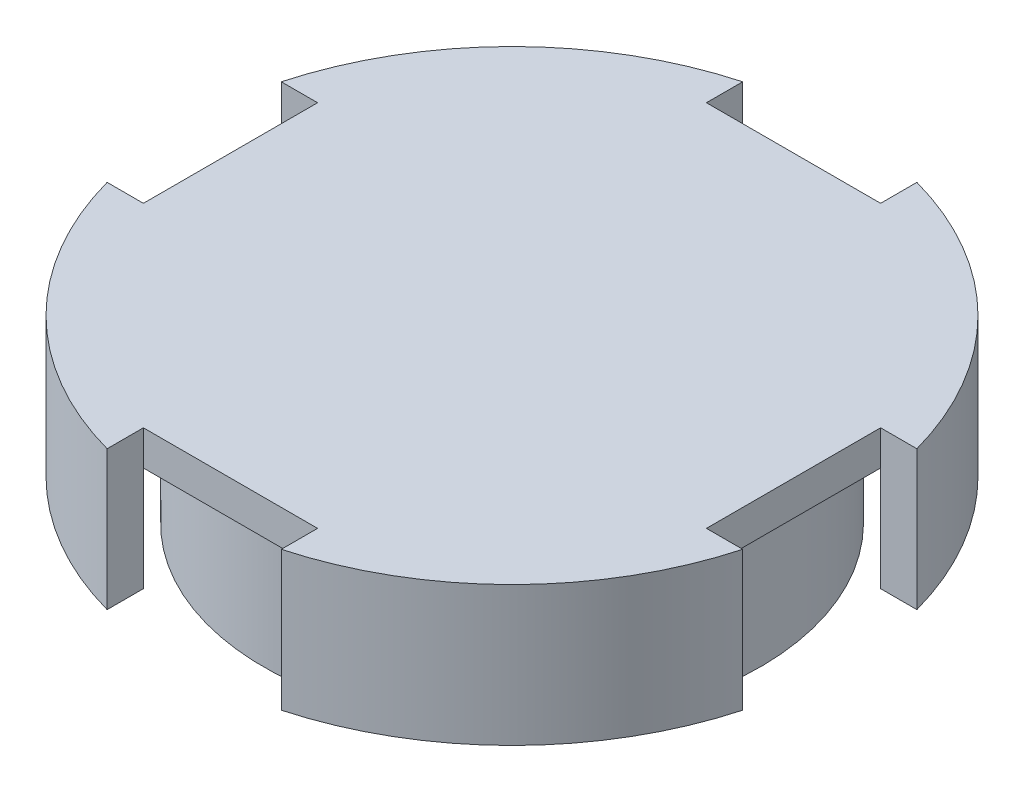
ISO-10303-21;
HEADER;
FILE_DESCRIPTION(('STEP AP214'),'2;1');
FILE_NAME('part.step','',(''),(''),'','','');
FILE_SCHEMA(('AUTOMOTIVE_DESIGN { 1 0 10303 214 1 1 1 1 }'));
ENDSEC;
DATA;
#1=APPLICATION_CONTEXT('core data for automotive mechanical design processes');
#2=APPLICATION_PROTOCOL_DEFINITION('international standard','automotive_design',2000,#1);
#3=PRODUCT_CONTEXT('',#1,'mechanical');
#4=PRODUCT('Part','Part','',(#3));
#5=PRODUCT_RELATED_PRODUCT_CATEGORY('part','',(#4));
#6=PRODUCT_DEFINITION_FORMATION('','',#4);
#7=PRODUCT_DEFINITION_CONTEXT('part definition',#1,'design');
#8=PRODUCT_DEFINITION('design','',#6,#7);
#9=PRODUCT_DEFINITION_SHAPE('','',#8);
#10=(LENGTH_UNIT() NAMED_UNIT(*) SI_UNIT(.MILLI.,.METRE.));
#11=(NAMED_UNIT(*) PLANE_ANGLE_UNIT() SI_UNIT($,.RADIAN.));
#12=(NAMED_UNIT(*) SI_UNIT($,.STERADIAN.) SOLID_ANGLE_UNIT());
#13=UNCERTAINTY_MEASURE_WITH_UNIT(LENGTH_MEASURE(1.E-05),#10,'distance_accuracy_value','');
#14=(GEOMETRIC_REPRESENTATION_CONTEXT(3) GLOBAL_UNCERTAINTY_ASSIGNED_CONTEXT((#13)) GLOBAL_UNIT_ASSIGNED_CONTEXT((#10,
#11,#12)) REPRESENTATION_CONTEXT('',''));
#15=CARTESIAN_POINT('',(0.,0.,0.));
#16=DIRECTION('',(0.,0.,1.));
#17=DIRECTION('',(1.,0.,0.));
#18=AXIS2_PLACEMENT_3D('',#15,#16,#17);
#19=CARTESIAN_POINT('',(0.,11.5,0.));
#20=DIRECTION('',(0.,-1.,0.));
#21=DIRECTION('',(0.,0.,-1.));
#22=AXIS2_PLACEMENT_3D('',#19,#20,#21);
#23=CYLINDRICAL_SURFACE('',#22,21.4);
#24=CARTESIAN_POINT('',(0.,0.,0.));
#25=DIRECTION('',(0.,1.,0.));
#26=DIRECTION('',(0.,0.,1.));
#27=AXIS2_PLACEMENT_3D('',#24,#25,#26);
#28=CIRCLE('',#27,21.4);
#29=CARTESIAN_POINT('',(-2.05,0.,-21.3015844481109));
#30=VERTEX_POINT('',#29);
#31=CARTESIAN_POINT('',(2.05,0.,-21.3015844481109));
#32=VERTEX_POINT('',#31);
#33=EDGE_CURVE('E121',#30,#32,#28,.T.);
#34=ORIENTED_EDGE('',*,*,#33,.T.);
#35=DIRECTION('',(0.,-1.,0.));
#36=VECTOR('',#35,1.);
#37=CARTESIAN_POINT('',(2.05,11.5,-21.3015844481109));
#38=LINE('',#37,#36);
#39=CARTESIAN_POINT('',(2.05,11.5,-21.3015844481109));
#40=VERTEX_POINT('',#39);
#41=EDGE_CURVE('E111',#40,#32,#38,.T.);
#42=ORIENTED_EDGE('',*,*,#41,.F.);
#43=CARTESIAN_POINT('',(0.,11.5,0.));
#44=DIRECTION('',(0.,1.,0.));
#45=DIRECTION('',(0.,0.,1.));
#46=AXIS2_PLACEMENT_3D('',#43,#44,#45);
#47=CIRCLE('',#46,21.4);
#48=CARTESIAN_POINT('',(-2.05,11.5,-21.3015844481109));
#49=VERTEX_POINT('',#48);
#50=EDGE_CURVE('E145',#40,#49,#47,.T.);
#51=ORIENTED_EDGE('',*,*,#50,.T.);
#52=DIRECTION('',(0.,-1.,0.));
#53=VECTOR('',#52,1.);
#54=CARTESIAN_POINT('',(-2.05,11.5,-21.3015844481109));
#55=LINE('',#54,#53);
#56=EDGE_CURVE('E78',#49,#30,#55,.T.);
#57=ORIENTED_EDGE('',*,*,#56,.T.);
#58=EDGE_LOOP('',(#34,#42,#51,#57));
#59=FACE_BOUND('',#58,.T.);
#60=CARTESIAN_POINT('',(0.,12.5,0.));
#61=DIRECTION('',(0.,1.,0.));
#62=DIRECTION('',(0.,0.,1.));
#63=AXIS2_PLACEMENT_3D('',#60,#61,#62);
#64=CIRCLE('',#63,21.4);
#65=CARTESIAN_POINT('',(0.,12.5,21.4));
#66=VERTEX_POINT('',#65);
#67=EDGE_CURVE('E12',#66,#66,#64,.T.);
#68=ORIENTED_EDGE('',*,*,#67,.F.);
#69=EDGE_LOOP('',(#68));
#70=FACE_BOUND('',#69,.T.);
#71=ADVANCED_FACE('F68',(#59,#70),#23,.T.);
#72=CARTESIAN_POINT('',(-2.05,11.5,0.));
#73=DIRECTION('',(-1.,0.,0.));
#74=DIRECTION('',(0.,0.,1.));
#75=AXIS2_PLACEMENT_3D('',#72,#73,#74);
#76=PLANE('',#75);
#77=DIRECTION('',(0.,0.,-1.));
#78=VECTOR('',#77,1.);
#79=CARTESIAN_POINT('',(-2.05,0.,0.));
#80=LINE('',#79,#78);
#81=CARTESIAN_POINT('',(-2.05,0.,-16.3015844481109));
#82=VERTEX_POINT('',#81);
#83=EDGE_CURVE('E126',#82,#30,#80,.T.);
#84=ORIENTED_EDGE('',*,*,#83,.T.);
#85=ORIENTED_EDGE('',*,*,#56,.F.);
#86=DIRECTION('',(0.,0.,-1.));
#87=VECTOR('',#86,1.);
#88=CARTESIAN_POINT('',(-2.05,11.5,0.));
#89=LINE('',#88,#87);
#90=CARTESIAN_POINT('',(-2.05,11.5,-16.3015844481109));
#91=VERTEX_POINT('',#90);
#92=EDGE_CURVE('E128',#91,#49,#89,.T.);
#93=ORIENTED_EDGE('',*,*,#92,.F.);
#94=DIRECTION('',(0.,-1.,0.));
#95=VECTOR('',#94,1.);
#96=CARTESIAN_POINT('',(-2.05,11.5,-16.3015844481109));
#97=LINE('',#96,#95);
#98=EDGE_CURVE('E112',#91,#82,#97,.T.);
#99=ORIENTED_EDGE('',*,*,#98,.T.);
#100=EDGE_LOOP('',(#84,#85,#93,#99));
#101=FACE_BOUND('',#100,.T.);
#102=ADVANCED_FACE('F70',(#101),#76,.F.);
#103=CARTESIAN_POINT('',(2.05,11.5,0.));
#104=DIRECTION('',(-1.,0.,0.));
#105=DIRECTION('',(0.,0.,1.));
#106=AXIS2_PLACEMENT_3D('',#103,#104,#105);
#107=PLANE('',#106);
#108=DIRECTION('',(0.,0.,-1.));
#109=VECTOR('',#108,1.);
#110=CARTESIAN_POINT('',(2.05,0.,0.));
#111=LINE('',#110,#109);
#112=CARTESIAN_POINT('',(2.05,0.,-16.3015844481109));
#113=VERTEX_POINT('',#112);
#114=EDGE_CURVE('E115',#113,#32,#111,.T.);
#115=ORIENTED_EDGE('',*,*,#114,.F.);
#116=DIRECTION('',(0.,-1.,0.));
#117=VECTOR('',#116,1.);
#118=CARTESIAN_POINT('',(2.05,11.5,-16.3015844481109));
#119=LINE('',#118,#117);
#120=CARTESIAN_POINT('',(2.05,11.5,-16.3015844481109));
#121=VERTEX_POINT('',#120);
#122=EDGE_CURVE('E102',#121,#113,#119,.T.);
#123=ORIENTED_EDGE('',*,*,#122,.F.);
#124=DIRECTION('',(0.,0.,-1.));
#125=VECTOR('',#124,1.);
#126=CARTESIAN_POINT('',(2.05,11.5,0.));
#127=LINE('',#126,#125);
#128=EDGE_CURVE('E85',#121,#40,#127,.T.);
#129=ORIENTED_EDGE('',*,*,#128,.T.);
#130=ORIENTED_EDGE('',*,*,#41,.T.);
#131=EDGE_LOOP('',(#115,#123,#129,#130));
#132=FACE_BOUND('',#131,.T.);
#133=ADVANCED_FACE('F116',(#132),#107,.T.);
#134=CARTESIAN_POINT('',(0.,11.5,-16.3015844481109));
#135=DIRECTION('',(0.,0.,-1.));
#136=DIRECTION('',(-1.,0.,0.));
#137=AXIS2_PLACEMENT_3D('',#134,#135,#136);
#138=PLANE('',#137);
#139=DIRECTION('',(1.,0.,0.));
#140=VECTOR('',#139,1.);
#141=CARTESIAN_POINT('',(0.,0.,-16.3015844481109));
#142=LINE('',#141,#140);
#143=EDGE_CURVE('E107',#82,#113,#142,.T.);
#144=ORIENTED_EDGE('',*,*,#143,.F.);
#145=ORIENTED_EDGE('',*,*,#98,.F.);
#146=DIRECTION('',(1.,0.,0.));
#147=VECTOR('',#146,1.);
#148=CARTESIAN_POINT('',(0.,11.5,-16.3015844481109));
#149=LINE('',#148,#147);
#150=EDGE_CURVE('E108',#91,#121,#149,.T.);
#151=ORIENTED_EDGE('',*,*,#150,.T.);
#152=ORIENTED_EDGE('',*,*,#122,.T.);
#153=EDGE_LOOP('',(#144,#145,#151,#152));
#154=FACE_BOUND('',#153,.T.);
#155=ADVANCED_FACE('F104',(#154),#138,.T.);
#156=CARTESIAN_POINT('',(0.,0.,0.));
#157=DIRECTION('',(0.,1.,0.));
#158=DIRECTION('',(0.,0.,1.));
#159=AXIS2_PLACEMENT_3D('',#156,#157,#158);
#160=PLANE('',#159);
#161=CARTESIAN_POINT('',(-8.6,0.,0.));
#162=DIRECTION('',(0.,1.,0.));
#163=DIRECTION('',(0.,0.,1.));
#164=AXIS2_PLACEMENT_3D('',#161,#162,#163);
#165=CIRCLE('',#164,1.55);
#166=CARTESIAN_POINT('',(-8.6,0.,1.55));
#167=VERTEX_POINT('',#166);
#168=EDGE_CURVE('E149',#167,#167,#165,.T.);
#169=ORIENTED_EDGE('',*,*,#168,.T.);
#170=EDGE_LOOP('',(#169));
#171=FACE_BOUND('',#170,.T.);
#172=CARTESIAN_POINT('',(8.6,0.,0.));
#173=DIRECTION('',(0.,1.,0.));
#174=DIRECTION('',(0.,0.,1.));
#175=AXIS2_PLACEMENT_3D('',#172,#173,#174);
#176=CIRCLE('',#175,1.55);
#177=CARTESIAN_POINT('',(8.6,0.,1.55));
#178=VERTEX_POINT('',#177);
#179=EDGE_CURVE('E164',#178,#178,#176,.T.);
#180=ORIENTED_EDGE('',*,*,#179,.T.);
#181=EDGE_LOOP('',(#180));
#182=FACE_BOUND('',#181,.T.);
#183=ORIENTED_EDGE('',*,*,#83,.F.);
#184=ORIENTED_EDGE('',*,*,#143,.T.);
#185=ORIENTED_EDGE('',*,*,#114,.T.);
#186=ORIENTED_EDGE('',*,*,#33,.F.);
#187=EDGE_LOOP('',(#183,#184,#185,#186));
#188=FACE_BOUND('',#187,.T.);
#189=ADVANCED_FACE('F124',(#171,#182,#188),#160,.F.);
#190=CARTESIAN_POINT('',(0.,-5.,0.));
#191=DIRECTION('',(0.,1.,0.));
#192=DIRECTION('',(0.,0.,1.));
#193=AXIS2_PLACEMENT_3D('',#190,#191,#192);
#194=PLANE('',#193);
#195=CARTESIAN_POINT('',(-8.6,-5.,0.));
#196=DIRECTION('',(0.,1.,0.));
#197=DIRECTION('',(0.,0.,1.));
#198=AXIS2_PLACEMENT_3D('',#195,#196,#197);
#199=CIRCLE('',#198,1.55);
#200=CARTESIAN_POINT('',(-8.6,-5.,1.55));
#201=VERTEX_POINT('',#200);
#202=EDGE_CURVE('E154',#201,#201,#199,.T.);
#203=ORIENTED_EDGE('',*,*,#202,.F.);
#204=EDGE_LOOP('',(#203));
#205=FACE_BOUND('',#204,.T.);
#206=ADVANCED_FACE('F575',(#205),#194,.F.);
#207=CARTESIAN_POINT('',(-8.6,-5.,0.));
#208=DIRECTION('',(0.,1.,0.));
#209=DIRECTION('',(0.,0.,1.));
#210=AXIS2_PLACEMENT_3D('',#207,#208,#209);
#211=CYLINDRICAL_SURFACE('',#210,1.55);
#212=ORIENTED_EDGE('',*,*,#202,.T.);
#213=EDGE_LOOP('',(#212));
#214=FACE_BOUND('',#213,.T.);
#215=ORIENTED_EDGE('',*,*,#168,.F.);
#216=EDGE_LOOP('',(#215));
#217=FACE_BOUND('',#216,.T.);
#218=ADVANCED_FACE('F577',(#214,#217),#211,.T.);
#219=CARTESIAN_POINT('',(0.,-5.,0.));
#220=DIRECTION('',(0.,1.,0.));
#221=DIRECTION('',(0.,0.,1.));
#222=AXIS2_PLACEMENT_3D('',#219,#220,#221);
#223=PLANE('',#222);
#224=CARTESIAN_POINT('',(8.6,-5.,0.));
#225=DIRECTION('',(0.,1.,0.));
#226=DIRECTION('',(0.,0.,1.));
#227=AXIS2_PLACEMENT_3D('',#224,#225,#226);
#228=CIRCLE('',#227,1.55);
#229=CARTESIAN_POINT('',(8.6,-5.,1.55));
#230=VERTEX_POINT('',#229);
#231=EDGE_CURVE('E168',#230,#230,#228,.T.);
#232=ORIENTED_EDGE('',*,*,#231,.F.);
#233=EDGE_LOOP('',(#232));
#234=FACE_BOUND('',#233,.T.);
#235=ADVANCED_FACE('F559',(#234),#223,.F.);
#236=CARTESIAN_POINT('',(8.6,-5.,0.));
#237=DIRECTION('',(0.,1.,0.));
#238=DIRECTION('',(0.,0.,1.));
#239=AXIS2_PLACEMENT_3D('',#236,#237,#238);
#240=CYLINDRICAL_SURFACE('',#239,1.55);
#241=ORIENTED_EDGE('',*,*,#231,.T.);
#242=EDGE_LOOP('',(#241));
#243=FACE_BOUND('',#242,.T.);
#244=ORIENTED_EDGE('',*,*,#179,.F.);
#245=EDGE_LOOP('',(#244));
#246=FACE_BOUND('',#245,.T.);
#247=ADVANCED_FACE('F550',(#243,#246),#240,.T.);
#248=CARTESIAN_POINT('',(0.,11.5,0.));
#249=DIRECTION('',(0.,1.,0.));
#250=DIRECTION('',(0.,0.,1.));
#251=AXIS2_PLACEMENT_3D('',#248,#249,#250);
#252=PLANE('',#251);
#253=ORIENTED_EDGE('',*,*,#150,.F.);
#254=ORIENTED_EDGE('',*,*,#92,.T.);
#255=ORIENTED_EDGE('',*,*,#50,.F.);
#256=ORIENTED_EDGE('',*,*,#128,.F.);
#257=EDGE_LOOP('',(#253,#254,#255,#256));
#258=FACE_BOUND('',#257,.T.);
#259=ADVANCED_FACE('F547',(#258),#252,.F.);
#260=CARTESIAN_POINT('',(-24.2412999857681,12.5,0.));
#261=DIRECTION('',(-1.,0.,0.));
#262=DIRECTION('',(0.,0.,1.));
#263=AXIS2_PLACEMENT_3D('',#260,#261,#262);
#264=PLANE('',#263);
#265=DIRECTION('',(0.,0.,1.));
#266=VECTOR('',#265,1.);
#267=CARTESIAN_POINT('',(-24.2412999857681,15.5,0.));
#268=LINE('',#267,#266);
#269=CARTESIAN_POINT('',(-24.2412999857681,15.5,-7.5));
#270=VERTEX_POINT('',#269);
#271=CARTESIAN_POINT('',(-24.2412999857681,15.5,7.5));
#272=VERTEX_POINT('',#271);
#273=EDGE_CURVE('E207',#270,#272,#268,.T.);
#274=ORIENTED_EDGE('',*,*,#273,.F.);
#275=DIRECTION('',(0.,1.,0.));
#276=VECTOR('',#275,1.);
#277=CARTESIAN_POINT('',(-24.2412999857681,12.5,-7.5));
#278=LINE('',#277,#276);
#279=CARTESIAN_POINT('',(-24.2412999857681,12.5,-7.5));
#280=VERTEX_POINT('',#279);
#281=EDGE_CURVE('E200',#280,#270,#278,.T.);
#282=ORIENTED_EDGE('',*,*,#281,.F.);
#283=DIRECTION('',(0.,0.,1.));
#284=VECTOR('',#283,1.);
#285=CARTESIAN_POINT('',(-24.2412999857681,12.5,0.));
#286=LINE('',#285,#284);
#287=CARTESIAN_POINT('',(-24.2412999857681,12.5,7.5));
#288=VERTEX_POINT('',#287);
#289=EDGE_CURVE('E180',#280,#288,#286,.T.);
#290=ORIENTED_EDGE('',*,*,#289,.T.);
#291=DIRECTION('',(0.,1.,0.));
#292=VECTOR('',#291,1.);
#293=CARTESIAN_POINT('',(-24.2412999857681,12.5,7.49999999999999));
#294=LINE('',#293,#292);
#295=EDGE_CURVE('E174',#288,#272,#294,.T.);
#296=ORIENTED_EDGE('',*,*,#295,.T.);
#297=EDGE_LOOP('',(#274,#282,#290,#296));
#298=FACE_BOUND('',#297,.T.);
#299=ADVANCED_FACE('F549',(#298),#264,.T.);
#300=CARTESIAN_POINT('',(0.,12.5,-24.2412999857681));
#301=DIRECTION('',(0.,0.,-1.));
#302=DIRECTION('',(-1.,0.,0.));
#303=AXIS2_PLACEMENT_3D('',#300,#301,#302);
#304=PLANE('',#303);
#305=DIRECTION('',(-1.,0.,0.));
#306=VECTOR('',#305,1.);
#307=CARTESIAN_POINT('',(0.,15.5,-24.2412999857681));
#308=LINE('',#307,#306);
#309=CARTESIAN_POINT('',(7.5,15.5,-24.2412999857681));
#310=VERTEX_POINT('',#309);
#311=CARTESIAN_POINT('',(-7.5,15.5,-24.2412999857681));
#312=VERTEX_POINT('',#311);
#313=EDGE_CURVE('E212',#310,#312,#308,.T.);
#314=ORIENTED_EDGE('',*,*,#313,.F.);
#315=DIRECTION('',(0.,1.,0.));
#316=VECTOR('',#315,1.);
#317=CARTESIAN_POINT('',(7.5,12.5,-24.2412999857681));
#318=LINE('',#317,#316);
#319=CARTESIAN_POINT('',(7.5,12.5,-24.2412999857681));
#320=VERTEX_POINT('',#319);
#321=EDGE_CURVE('E192',#320,#310,#318,.T.);
#322=ORIENTED_EDGE('',*,*,#321,.F.);
#323=DIRECTION('',(-1.,0.,0.));
#324=VECTOR('',#323,1.);
#325=CARTESIAN_POINT('',(0.,12.5,-24.2412999857681));
#326=LINE('',#325,#324);
#327=CARTESIAN_POINT('',(-7.5,12.5,-24.2412999857681));
#328=VERTEX_POINT('',#327);
#329=EDGE_CURVE('E232',#320,#328,#326,.T.);
#330=ORIENTED_EDGE('',*,*,#329,.T.);
#331=DIRECTION('',(0.,1.,0.));
#332=VECTOR('',#331,1.);
#333=CARTESIAN_POINT('',(-7.49999999999999,12.5,-24.2412999857681));
#334=LINE('',#333,#332);
#335=EDGE_CURVE('E196',#328,#312,#334,.T.);
#336=ORIENTED_EDGE('',*,*,#335,.T.);
#337=EDGE_LOOP('',(#314,#322,#330,#336));
#338=FACE_BOUND('',#337,.T.);
#339=ADVANCED_FACE('F556',(#338),#304,.T.);
#340=CARTESIAN_POINT('',(24.2412999857681,12.5,0.));
#341=DIRECTION('',(1.,0.,0.));
#342=DIRECTION('',(0.,0.,-1.));
#343=AXIS2_PLACEMENT_3D('',#340,#341,#342);
#344=PLANE('',#343);
#345=DIRECTION('',(0.,0.,-1.));
#346=VECTOR('',#345,1.);
#347=CARTESIAN_POINT('',(24.2412999857681,15.5,0.));
#348=LINE('',#347,#346);
#349=CARTESIAN_POINT('',(24.2412999857681,15.5,7.49999999999999));
#350=VERTEX_POINT('',#349);
#351=CARTESIAN_POINT('',(24.2412999857681,15.5,-7.5));
#352=VERTEX_POINT('',#351);
#353=EDGE_CURVE('E216',#350,#352,#348,.T.);
#354=ORIENTED_EDGE('',*,*,#353,.F.);
#355=DIRECTION('',(0.,1.,0.));
#356=VECTOR('',#355,1.);
#357=CARTESIAN_POINT('',(24.2412999857681,12.5,7.49999999999999));
#358=LINE('',#357,#356);
#359=CARTESIAN_POINT('',(24.2412999857681,12.5,7.49999999999999));
#360=VERTEX_POINT('',#359);
#361=EDGE_CURVE('E184',#360,#350,#358,.T.);
#362=ORIENTED_EDGE('',*,*,#361,.F.);
#363=DIRECTION('',(0.,0.,-1.));
#364=VECTOR('',#363,1.);
#365=CARTESIAN_POINT('',(24.2412999857681,12.5,0.));
#366=LINE('',#365,#364);
#367=CARTESIAN_POINT('',(24.2412999857681,12.5,-7.5));
#368=VERTEX_POINT('',#367);
#369=EDGE_CURVE('E240',#360,#368,#366,.T.);
#370=ORIENTED_EDGE('',*,*,#369,.T.);
#371=DIRECTION('',(0.,1.,0.));
#372=VECTOR('',#371,1.);
#373=CARTESIAN_POINT('',(24.2412999857681,12.5,-7.5));
#374=LINE('',#373,#372);
#375=EDGE_CURVE('E188',#368,#352,#374,.T.);
#376=ORIENTED_EDGE('',*,*,#375,.T.);
#377=EDGE_LOOP('',(#354,#362,#370,#376));
#378=FACE_BOUND('',#377,.T.);
#379=ADVANCED_FACE('F641',(#378),#344,.T.);
#380=CARTESIAN_POINT('',(0.,12.5,24.2412999857681));
#381=DIRECTION('',(0.,0.,1.));
#382=DIRECTION('',(1.,0.,0.));
#383=AXIS2_PLACEMENT_3D('',#380,#381,#382);
#384=PLANE('',#383);
#385=DIRECTION('',(1.,0.,0.));
#386=VECTOR('',#385,1.);
#387=CARTESIAN_POINT('',(0.,15.5,24.2412999857681));
#388=LINE('',#387,#386);
#389=CARTESIAN_POINT('',(-7.5,15.5,24.2412999857681));
#390=VERTEX_POINT('',#389);
#391=CARTESIAN_POINT('',(7.5,15.5,24.2412999857681));
#392=VERTEX_POINT('',#391);
#393=EDGE_CURVE('E220',#390,#392,#388,.T.);
#394=ORIENTED_EDGE('',*,*,#393,.F.);
#395=DIRECTION('',(0.,1.,0.));
#396=VECTOR('',#395,1.);
#397=CARTESIAN_POINT('',(-7.5,12.5,24.2412999857681));
#398=LINE('',#397,#396);
#399=CARTESIAN_POINT('',(-7.5,12.5,24.2412999857681));
#400=VERTEX_POINT('',#399);
#401=EDGE_CURVE('E175',#400,#390,#398,.T.);
#402=ORIENTED_EDGE('',*,*,#401,.F.);
#403=DIRECTION('',(1.,0.,0.));
#404=VECTOR('',#403,1.);
#405=CARTESIAN_POINT('',(0.,12.5,24.2412999857681));
#406=LINE('',#405,#404);
#407=CARTESIAN_POINT('',(7.5,12.5,24.2412999857681));
#408=VERTEX_POINT('',#407);
#409=EDGE_CURVE('E248',#400,#408,#406,.T.);
#410=ORIENTED_EDGE('',*,*,#409,.T.);
#411=DIRECTION('',(0.,1.,0.));
#412=VECTOR('',#411,1.);
#413=CARTESIAN_POINT('',(7.5,12.5,24.2412999857681));
#414=LINE('',#413,#412);
#415=EDGE_CURVE('E179',#408,#392,#414,.T.);
#416=ORIENTED_EDGE('',*,*,#415,.T.);
#417=EDGE_LOOP('',(#394,#402,#410,#416));
#418=FACE_BOUND('',#417,.T.);
#419=ADVANCED_FACE('F651',(#418),#384,.T.);
#420=CARTESIAN_POINT('',(0.,12.5,0.));
#421=DIRECTION('',(0.,1.,0.));
#422=DIRECTION('',(0.,0.,1.));
#423=AXIS2_PLACEMENT_3D('',#420,#421,#422);
#424=PLANE('',#423);
#425=ORIENTED_EDGE('',*,*,#67,.T.);
#426=EDGE_LOOP('',(#425));
#427=FACE_BOUND('',#426,.T.);
#428=CARTESIAN_POINT('',(0.,12.5,0.));
#429=DIRECTION('',(0.,1.,0.));
#430=DIRECTION('',(0.,0.,1.));
#431=AXIS2_PLACEMENT_3D('',#428,#429,#430);
#432=CIRCLE('',#431,25.375);
#433=EDGE_CURVE('E211',#288,#400,#432,.T.);
#434=ORIENTED_EDGE('',*,*,#433,.F.);
#435=ORIENTED_EDGE('',*,*,#289,.F.);
#436=CARTESIAN_POINT('',(0.,12.5,0.));
#437=DIRECTION('',(0.,1.,0.));
#438=DIRECTION('',(0.,0.,1.));
#439=AXIS2_PLACEMENT_3D('',#436,#437,#438);
#440=CIRCLE('',#439,25.375);
#441=EDGE_CURVE('E228',#328,#280,#440,.T.);
#442=ORIENTED_EDGE('',*,*,#441,.F.);
#443=ORIENTED_EDGE('',*,*,#329,.F.);
#444=CARTESIAN_POINT('',(0.,12.5,0.));
#445=DIRECTION('',(0.,1.,0.));
#446=DIRECTION('',(0.,0.,1.));
#447=AXIS2_PLACEMENT_3D('',#444,#445,#446);
#448=CIRCLE('',#447,25.375);
#449=EDGE_CURVE('E236',#368,#320,#448,.T.);
#450=ORIENTED_EDGE('',*,*,#449,.F.);
#451=ORIENTED_EDGE('',*,*,#369,.F.);
#452=CARTESIAN_POINT('',(0.,12.5,0.));
#453=DIRECTION('',(0.,1.,0.));
#454=DIRECTION('',(0.,0.,1.));
#455=AXIS2_PLACEMENT_3D('',#452,#453,#454);
#456=CIRCLE('',#455,25.375);
#457=EDGE_CURVE('E244',#408,#360,#456,.T.);
#458=ORIENTED_EDGE('',*,*,#457,.F.);
#459=ORIENTED_EDGE('',*,*,#409,.F.);
#460=EDGE_LOOP('',(#434,#435,#442,#443,#450,#451,#458,#459));
#461=FACE_BOUND('',#460,.T.);
#462=ADVANCED_FACE('F661',(#427,#461),#424,.F.);
#463=CARTESIAN_POINT('',(0.,15.5,0.));
#464=DIRECTION('',(0.,1.,0.));
#465=DIRECTION('',(0.,0.,1.));
#466=AXIS2_PLACEMENT_3D('',#463,#464,#465);
#467=PLANE('',#466);
#468=ORIENTED_EDGE('',*,*,#273,.T.);
#469=DIRECTION('',(-1.,0.,0.));
#470=VECTOR('',#469,1.);
#471=CARTESIAN_POINT('',(0.,15.5,7.50000000000004));
#472=LINE('',#471,#470);
#473=CARTESIAN_POINT('',(-27.3658660560926,15.5,7.49999999999998));
#474=VERTEX_POINT('',#473);
#475=EDGE_CURVE('E315',#272,#474,#472,.T.);
#476=ORIENTED_EDGE('',*,*,#475,.T.);
#477=CARTESIAN_POINT('',(0.,15.5,0.));
#478=DIRECTION('',(0.,1.,0.));
#479=DIRECTION('',(0.,0.,1.));
#480=AXIS2_PLACEMENT_3D('',#477,#478,#479);
#481=CIRCLE('',#480,28.375);
#482=CARTESIAN_POINT('',(-7.5,15.5,27.3658660560926));
#483=VERTEX_POINT('',#482);
#484=EDGE_CURVE('E320',#474,#483,#481,.T.);
#485=ORIENTED_EDGE('',*,*,#484,.T.);
#486=DIRECTION('',(0.,0.,-1.));
#487=VECTOR('',#486,1.);
#488=CARTESIAN_POINT('',(-7.5,15.5,0.));
#489=LINE('',#488,#487);
#490=EDGE_CURVE('E324',#483,#390,#489,.T.);
#491=ORIENTED_EDGE('',*,*,#490,.T.);
#492=ORIENTED_EDGE('',*,*,#393,.T.);
#493=DIRECTION('',(0.,0.,1.));
#494=VECTOR('',#493,1.);
#495=CARTESIAN_POINT('',(7.5,15.5,0.));
#496=LINE('',#495,#494);
#497=CARTESIAN_POINT('',(7.5,15.5,27.3658660560926));
#498=VERTEX_POINT('',#497);
#499=EDGE_CURVE('E271',#392,#498,#496,.T.);
#500=ORIENTED_EDGE('',*,*,#499,.T.);
#501=CARTESIAN_POINT('',(0.,15.5,0.));
#502=DIRECTION('',(0.,1.,0.));
#503=DIRECTION('',(0.,0.,1.));
#504=AXIS2_PLACEMENT_3D('',#501,#502,#503);
#505=CIRCLE('',#504,28.375);
#506=CARTESIAN_POINT('',(27.3658660560926,15.5,7.5));
#507=VERTEX_POINT('',#506);
#508=EDGE_CURVE('E276',#498,#507,#505,.T.);
#509=ORIENTED_EDGE('',*,*,#508,.T.);
#510=DIRECTION('',(-1.,0.,0.));
#511=VECTOR('',#510,1.);
#512=CARTESIAN_POINT('',(0.,15.5,7.49999999999997));
#513=LINE('',#512,#511);
#514=EDGE_CURVE('E280',#507,#350,#513,.T.);
#515=ORIENTED_EDGE('',*,*,#514,.T.);
#516=ORIENTED_EDGE('',*,*,#353,.T.);
#517=DIRECTION('',(1.,0.,0.));
#518=VECTOR('',#517,1.);
#519=CARTESIAN_POINT('',(0.,15.5,-7.5));
#520=LINE('',#519,#518);
#521=CARTESIAN_POINT('',(27.3658660560926,15.5,-7.5));
#522=VERTEX_POINT('',#521);
#523=EDGE_CURVE('E403',#352,#522,#520,.T.);
#524=ORIENTED_EDGE('',*,*,#523,.T.);
#525=CARTESIAN_POINT('',(0.,15.5,0.));
#526=DIRECTION('',(0.,1.,0.));
#527=DIRECTION('',(0.,0.,1.));
#528=AXIS2_PLACEMENT_3D('',#525,#526,#527);
#529=CIRCLE('',#528,28.375);
#530=CARTESIAN_POINT('',(7.5,15.5,-27.3658660560926));
#531=VERTEX_POINT('',#530);
#532=EDGE_CURVE('E408',#522,#531,#529,.T.);
#533=ORIENTED_EDGE('',*,*,#532,.T.);
#534=DIRECTION('',(0.,0.,1.));
#535=VECTOR('',#534,1.);
#536=CARTESIAN_POINT('',(7.5,15.5,0.));
#537=LINE('',#536,#535);
#538=EDGE_CURVE('E412',#531,#310,#537,.T.);
#539=ORIENTED_EDGE('',*,*,#538,.T.);
#540=ORIENTED_EDGE('',*,*,#313,.T.);
#541=DIRECTION('',(0.,0.,-1.));
#542=VECTOR('',#541,1.);
#543=CARTESIAN_POINT('',(-7.5,15.5,0.));
#544=LINE('',#543,#542);
#545=CARTESIAN_POINT('',(-7.49999999999999,15.5,-27.3658660560926));
#546=VERTEX_POINT('',#545);
#547=EDGE_CURVE('E359',#312,#546,#544,.T.);
#548=ORIENTED_EDGE('',*,*,#547,.T.);
#549=CARTESIAN_POINT('',(0.,15.5,0.));
#550=DIRECTION('',(0.,1.,0.));
#551=DIRECTION('',(0.,0.,1.));
#552=AXIS2_PLACEMENT_3D('',#549,#550,#551);
#553=CIRCLE('',#552,28.375);
#554=CARTESIAN_POINT('',(-27.3658660560926,15.5,-7.49999999999999));
#555=VERTEX_POINT('',#554);
#556=EDGE_CURVE('E364',#546,#555,#553,.T.);
#557=ORIENTED_EDGE('',*,*,#556,.T.);
#558=DIRECTION('',(1.,0.,0.));
#559=VECTOR('',#558,1.);
#560=CARTESIAN_POINT('',(0.,15.5,-7.5));
#561=LINE('',#560,#559);
#562=EDGE_CURVE('E368',#555,#270,#561,.T.);
#563=ORIENTED_EDGE('',*,*,#562,.T.);
#564=EDGE_LOOP('',(#468,#476,#485,#491,#492,#500,#509,#515,#516,#524,#533,#539,#540,#548,#557,#563));
#565=FACE_BOUND('',#564,.T.);
#566=ADVANCED_FACE('F671',(#565),#467,.T.);
#567=CARTESIAN_POINT('',(0.,3.5,0.));
#568=DIRECTION('',(0.,1.,0.));
#569=DIRECTION('',(0.,0.,1.));
#570=AXIS2_PLACEMENT_3D('',#567,#568,#569);
#571=CYLINDRICAL_SURFACE('',#570,25.375);
#572=DIRECTION('',(0.,1.,0.));
#573=VECTOR('',#572,1.);
#574=CARTESIAN_POINT('',(7.5,3.5,24.2412999857681));
#575=LINE('',#574,#573);
#576=CARTESIAN_POINT('',(7.5,3.5,24.2412999857681));
#577=VERTEX_POINT('',#576);
#578=EDGE_CURVE('E266',#577,#408,#575,.T.);
#579=ORIENTED_EDGE('',*,*,#578,.T.);
#580=ORIENTED_EDGE('',*,*,#457,.T.);
#581=DIRECTION('',(0.,1.,0.));
#582=VECTOR('',#581,1.);
#583=CARTESIAN_POINT('',(24.2412999857681,3.5,7.49999999999999));
#584=LINE('',#583,#582);
#585=CARTESIAN_POINT('',(24.2412999857681,3.5,7.49999999999999));
#586=VERTEX_POINT('',#585);
#587=EDGE_CURVE('E224',#586,#360,#584,.T.);
#588=ORIENTED_EDGE('',*,*,#587,.F.);
#589=CARTESIAN_POINT('',(0.,3.5,0.));
#590=DIRECTION('',(0.,1.,0.));
#591=DIRECTION('',(0.,0.,1.));
#592=AXIS2_PLACEMENT_3D('',#589,#590,#591);
#593=CIRCLE('',#592,25.375);
#594=EDGE_CURVE('E275',#577,#586,#593,.T.);
#595=ORIENTED_EDGE('',*,*,#594,.F.);
#596=EDGE_LOOP('',(#579,#580,#588,#595));
#597=FACE_BOUND('',#596,.T.);
#598=ADVANCED_FACE('F682',(#597),#571,.F.);
#599=CARTESIAN_POINT('',(0.,3.5,7.49999999999997));
#600=DIRECTION('',(0.,0.,-1.));
#601=DIRECTION('',(-1.,0.,0.));
#602=AXIS2_PLACEMENT_3D('',#599,#600,#601);
#603=PLANE('',#602);
#604=ORIENTED_EDGE('',*,*,#514,.F.);
#605=DIRECTION('',(0.,1.,0.));
#606=VECTOR('',#605,1.);
#607=CARTESIAN_POINT('',(27.3658660560926,3.5,7.5));
#608=LINE('',#607,#606);
#609=CARTESIAN_POINT('',(27.3658660560926,3.5,7.5));
#610=VERTEX_POINT('',#609);
#611=EDGE_CURVE('E258',#610,#507,#608,.T.);
#612=ORIENTED_EDGE('',*,*,#611,.F.);
#613=DIRECTION('',(-1.,0.,0.));
#614=VECTOR('',#613,1.);
#615=CARTESIAN_POINT('',(0.,3.5,7.49999999999997));
#616=LINE('',#615,#614);
#617=EDGE_CURVE('E292',#610,#586,#616,.T.);
#618=ORIENTED_EDGE('',*,*,#617,.T.);
#619=ORIENTED_EDGE('',*,*,#587,.T.);
#620=ORIENTED_EDGE('',*,*,#361,.T.);
#621=EDGE_LOOP('',(#604,#612,#618,#619,#620));
#622=FACE_BOUND('',#621,.T.);
#623=ADVANCED_FACE('F692',(#622),#603,.T.);
#624=CARTESIAN_POINT('',(0.,3.5,0.));
#625=DIRECTION('',(0.,1.,0.));
#626=DIRECTION('',(0.,0.,1.));
#627=AXIS2_PLACEMENT_3D('',#624,#625,#626);
#628=CYLINDRICAL_SURFACE('',#627,28.375);
#629=ORIENTED_EDGE('',*,*,#508,.F.);
#630=DIRECTION('',(0.,1.,0.));
#631=VECTOR('',#630,1.);
#632=CARTESIAN_POINT('',(7.5,3.5,27.3658660560926));
#633=LINE('',#632,#631);
#634=CARTESIAN_POINT('',(7.5,3.5,27.3658660560926));
#635=VERTEX_POINT('',#634);
#636=EDGE_CURVE('E262',#635,#498,#633,.T.);
#637=ORIENTED_EDGE('',*,*,#636,.F.);
#638=CARTESIAN_POINT('',(0.,3.5,0.));
#639=DIRECTION('',(0.,1.,0.));
#640=DIRECTION('',(0.,0.,1.));
#641=AXIS2_PLACEMENT_3D('',#638,#639,#640);
#642=CIRCLE('',#641,28.375);
#643=EDGE_CURVE('E288',#635,#610,#642,.T.);
#644=ORIENTED_EDGE('',*,*,#643,.T.);
#645=ORIENTED_EDGE('',*,*,#611,.T.);
#646=EDGE_LOOP('',(#629,#637,#644,#645));
#647=FACE_BOUND('',#646,.T.);
#648=ADVANCED_FACE('F702',(#647),#628,.T.);
#649=CARTESIAN_POINT('',(7.5,3.5,0.));
#650=DIRECTION('',(-1.,0.,0.));
#651=DIRECTION('',(0.,0.,1.));
#652=AXIS2_PLACEMENT_3D('',#649,#650,#651);
#653=PLANE('',#652);
#654=ORIENTED_EDGE('',*,*,#499,.F.);
#655=ORIENTED_EDGE('',*,*,#415,.F.);
#656=ORIENTED_EDGE('',*,*,#578,.F.);
#657=DIRECTION('',(0.,0.,1.));
#658=VECTOR('',#657,1.);
#659=CARTESIAN_POINT('',(7.5,3.5,0.));
#660=LINE('',#659,#658);
#661=EDGE_CURVE('E270',#577,#635,#660,.T.);
#662=ORIENTED_EDGE('',*,*,#661,.T.);
#663=ORIENTED_EDGE('',*,*,#636,.T.);
#664=EDGE_LOOP('',(#654,#655,#656,#662,#663));
#665=FACE_BOUND('',#664,.T.);
#666=ADVANCED_FACE('F712',(#665),#653,.T.);
#667=CARTESIAN_POINT('',(0.,3.5,0.));
#668=DIRECTION('',(0.,1.,0.));
#669=DIRECTION('',(0.,0.,1.));
#670=AXIS2_PLACEMENT_3D('',#667,#668,#669);
#671=PLANE('',#670);
#672=ORIENTED_EDGE('',*,*,#594,.T.);
#673=ORIENTED_EDGE('',*,*,#617,.F.);
#674=ORIENTED_EDGE('',*,*,#643,.F.);
#675=ORIENTED_EDGE('',*,*,#661,.F.);
#676=EDGE_LOOP('',(#672,#673,#674,#675));
#677=FACE_BOUND('',#676,.T.);
#678=ADVANCED_FACE('F722',(#677),#671,.F.);
#679=CARTESIAN_POINT('',(0.,3.5,0.));
#680=DIRECTION('',(0.,1.,0.));
#681=DIRECTION('',(0.,0.,1.));
#682=AXIS2_PLACEMENT_3D('',#679,#680,#681);
#683=CYLINDRICAL_SURFACE('',#682,25.375);
#684=DIRECTION('',(0.,1.,0.));
#685=VECTOR('',#684,1.);
#686=CARTESIAN_POINT('',(-24.2412999857681,3.5,7.5));
#687=LINE('',#686,#685);
#688=CARTESIAN_POINT('',(-24.2412999857681,3.5,7.5));
#689=VERTEX_POINT('',#688);
#690=EDGE_CURVE('E310',#689,#288,#687,.T.);
#691=ORIENTED_EDGE('',*,*,#690,.T.);
#692=ORIENTED_EDGE('',*,*,#433,.T.);
#693=DIRECTION('',(0.,1.,0.));
#694=VECTOR('',#693,1.);
#695=CARTESIAN_POINT('',(-7.5,3.5,24.2412999857681));
#696=LINE('',#695,#694);
#697=CARTESIAN_POINT('',(-7.5,3.5,24.2412999857681));
#698=VERTEX_POINT('',#697);
#699=EDGE_CURVE('E284',#698,#400,#696,.T.);
#700=ORIENTED_EDGE('',*,*,#699,.F.);
#701=CARTESIAN_POINT('',(0.,3.5,0.));
#702=DIRECTION('',(0.,1.,0.));
#703=DIRECTION('',(0.,0.,1.));
#704=AXIS2_PLACEMENT_3D('',#701,#702,#703);
#705=CIRCLE('',#704,25.375);
#706=EDGE_CURVE('E319',#689,#698,#705,.T.);
#707=ORIENTED_EDGE('',*,*,#706,.F.);
#708=EDGE_LOOP('',(#691,#692,#700,#707));
#709=FACE_BOUND('',#708,.T.);
#710=ADVANCED_FACE('F732',(#709),#683,.F.);
#711=CARTESIAN_POINT('',(-7.5,3.5,0.));
#712=DIRECTION('',(1.,0.,0.));
#713=DIRECTION('',(0.,0.,-1.));
#714=AXIS2_PLACEMENT_3D('',#711,#712,#713);
#715=PLANE('',#714);
#716=ORIENTED_EDGE('',*,*,#490,.F.);
#717=DIRECTION('',(0.,1.,0.));
#718=VECTOR('',#717,1.);
#719=CARTESIAN_POINT('',(-7.5,3.5,27.3658660560926));
#720=LINE('',#719,#718);
#721=CARTESIAN_POINT('',(-7.5,3.5,27.3658660560926));
#722=VERTEX_POINT('',#721);
#723=EDGE_CURVE('E302',#722,#483,#720,.T.);
#724=ORIENTED_EDGE('',*,*,#723,.F.);
#725=DIRECTION('',(0.,0.,-1.));
#726=VECTOR('',#725,1.);
#727=CARTESIAN_POINT('',(-7.5,3.5,0.));
#728=LINE('',#727,#726);
#729=EDGE_CURVE('E336',#722,#698,#728,.T.);
#730=ORIENTED_EDGE('',*,*,#729,.T.);
#731=ORIENTED_EDGE('',*,*,#699,.T.);
#732=ORIENTED_EDGE('',*,*,#401,.T.);
#733=EDGE_LOOP('',(#716,#724,#730,#731,#732));
#734=FACE_BOUND('',#733,.T.);
#735=ADVANCED_FACE('F742',(#734),#715,.T.);
#736=CARTESIAN_POINT('',(0.,3.5,0.));
#737=DIRECTION('',(0.,1.,0.));
#738=DIRECTION('',(0.,0.,1.));
#739=AXIS2_PLACEMENT_3D('',#736,#737,#738);
#740=CYLINDRICAL_SURFACE('',#739,28.375);
#741=ORIENTED_EDGE('',*,*,#484,.F.);
#742=DIRECTION('',(0.,1.,0.));
#743=VECTOR('',#742,1.);
#744=CARTESIAN_POINT('',(-27.3658660560926,3.5,7.49999999999998));
#745=LINE('',#744,#743);
#746=CARTESIAN_POINT('',(-27.3658660560926,3.5,7.49999999999998));
#747=VERTEX_POINT('',#746);
#748=EDGE_CURVE('E306',#747,#474,#745,.T.);
#749=ORIENTED_EDGE('',*,*,#748,.F.);
#750=CARTESIAN_POINT('',(0.,3.5,0.));
#751=DIRECTION('',(0.,1.,0.));
#752=DIRECTION('',(0.,0.,1.));
#753=AXIS2_PLACEMENT_3D('',#750,#751,#752);
#754=CIRCLE('',#753,28.375);
#755=EDGE_CURVE('E332',#747,#722,#754,.T.);
#756=ORIENTED_EDGE('',*,*,#755,.T.);
#757=ORIENTED_EDGE('',*,*,#723,.T.);
#758=EDGE_LOOP('',(#741,#749,#756,#757));
#759=FACE_BOUND('',#758,.T.);
#760=ADVANCED_FACE('F752',(#759),#740,.T.);
#761=CARTESIAN_POINT('',(0.,3.5,7.50000000000004));
#762=DIRECTION('',(0.,0.,-1.));
#763=DIRECTION('',(-1.,0.,0.));
#764=AXIS2_PLACEMENT_3D('',#761,#762,#763);
#765=PLANE('',#764);
#766=ORIENTED_EDGE('',*,*,#475,.F.);
#767=ORIENTED_EDGE('',*,*,#295,.F.);
#768=ORIENTED_EDGE('',*,*,#690,.F.);
#769=DIRECTION('',(-1.,0.,0.));
#770=VECTOR('',#769,1.);
#771=CARTESIAN_POINT('',(0.,3.5,7.50000000000004));
#772=LINE('',#771,#770);
#773=EDGE_CURVE('E314',#689,#747,#772,.T.);
#774=ORIENTED_EDGE('',*,*,#773,.T.);
#775=ORIENTED_EDGE('',*,*,#748,.T.);
#776=EDGE_LOOP('',(#766,#767,#768,#774,#775));
#777=FACE_BOUND('',#776,.T.);
#778=ADVANCED_FACE('F762',(#777),#765,.T.);
#779=CARTESIAN_POINT('',(0.,3.5,0.));
#780=DIRECTION('',(0.,1.,0.));
#781=DIRECTION('',(0.,0.,1.));
#782=AXIS2_PLACEMENT_3D('',#779,#780,#781);
#783=PLANE('',#782);
#784=ORIENTED_EDGE('',*,*,#706,.T.);
#785=ORIENTED_EDGE('',*,*,#729,.F.);
#786=ORIENTED_EDGE('',*,*,#755,.F.);
#787=ORIENTED_EDGE('',*,*,#773,.F.);
#788=EDGE_LOOP('',(#784,#785,#786,#787));
#789=FACE_BOUND('',#788,.T.);
#790=ADVANCED_FACE('F772',(#789),#783,.F.);
#791=CARTESIAN_POINT('',(0.,3.5,0.));
#792=DIRECTION('',(0.,1.,0.));
#793=DIRECTION('',(0.,0.,1.));
#794=AXIS2_PLACEMENT_3D('',#791,#792,#793);
#795=CYLINDRICAL_SURFACE('',#794,25.375);
#796=DIRECTION('',(0.,1.,0.));
#797=VECTOR('',#796,1.);
#798=CARTESIAN_POINT('',(-7.5,3.5,-24.2412999857681));
#799=LINE('',#798,#797);
#800=CARTESIAN_POINT('',(-7.5,3.5,-24.2412999857681));
#801=VERTEX_POINT('',#800);
#802=EDGE_CURVE('E354',#801,#328,#799,.T.);
#803=ORIENTED_EDGE('',*,*,#802,.T.);
#804=ORIENTED_EDGE('',*,*,#441,.T.);
#805=DIRECTION('',(0.,1.,0.));
#806=VECTOR('',#805,1.);
#807=CARTESIAN_POINT('',(-24.2412999857681,3.5,-7.5));
#808=LINE('',#807,#806);
#809=CARTESIAN_POINT('',(-24.2412999857681,3.5,-7.5));
#810=VERTEX_POINT('',#809);
#811=EDGE_CURVE('E328',#810,#280,#808,.T.);
#812=ORIENTED_EDGE('',*,*,#811,.F.);
#813=CARTESIAN_POINT('',(0.,3.5,0.));
#814=DIRECTION('',(0.,1.,0.));
#815=DIRECTION('',(0.,0.,1.));
#816=AXIS2_PLACEMENT_3D('',#813,#814,#815);
#817=CIRCLE('',#816,25.375);
#818=EDGE_CURVE('E363',#801,#810,#817,.T.);
#819=ORIENTED_EDGE('',*,*,#818,.F.);
#820=EDGE_LOOP('',(#803,#804,#812,#819));
#821=FACE_BOUND('',#820,.T.);
#822=ADVANCED_FACE('F782',(#821),#795,.F.);
#823=CARTESIAN_POINT('',(0.,3.5,-7.5));
#824=DIRECTION('',(0.,0.,1.));
#825=DIRECTION('',(1.,0.,0.));
#826=AXIS2_PLACEMENT_3D('',#823,#824,#825);
#827=PLANE('',#826);
#828=ORIENTED_EDGE('',*,*,#562,.F.);
#829=DIRECTION('',(0.,1.,0.));
#830=VECTOR('',#829,1.);
#831=CARTESIAN_POINT('',(-27.3658660560926,3.5,-7.49999999999999));
#832=LINE('',#831,#830);
#833=CARTESIAN_POINT('',(-27.3658660560926,3.5,-7.49999999999999));
#834=VERTEX_POINT('',#833);
#835=EDGE_CURVE('E346',#834,#555,#832,.T.);
#836=ORIENTED_EDGE('',*,*,#835,.F.);
#837=DIRECTION('',(1.,0.,0.));
#838=VECTOR('',#837,1.);
#839=CARTESIAN_POINT('',(0.,3.5,-7.5));
#840=LINE('',#839,#838);
#841=EDGE_CURVE('E380',#834,#810,#840,.T.);
#842=ORIENTED_EDGE('',*,*,#841,.T.);
#843=ORIENTED_EDGE('',*,*,#811,.T.);
#844=ORIENTED_EDGE('',*,*,#281,.T.);
#845=EDGE_LOOP('',(#828,#836,#842,#843,#844));
#846=FACE_BOUND('',#845,.T.);
#847=ADVANCED_FACE('F792',(#846),#827,.T.);
#848=CARTESIAN_POINT('',(0.,3.5,0.));
#849=DIRECTION('',(0.,1.,0.));
#850=DIRECTION('',(0.,0.,1.));
#851=AXIS2_PLACEMENT_3D('',#848,#849,#850);
#852=CYLINDRICAL_SURFACE('',#851,28.375);
#853=ORIENTED_EDGE('',*,*,#556,.F.);
#854=DIRECTION('',(0.,1.,0.));
#855=VECTOR('',#854,1.);
#856=CARTESIAN_POINT('',(-7.49999999999999,3.5,-27.3658660560926));
#857=LINE('',#856,#855);
#858=CARTESIAN_POINT('',(-7.49999999999999,3.5,-27.3658660560926));
#859=VERTEX_POINT('',#858);
#860=EDGE_CURVE('E350',#859,#546,#857,.T.);
#861=ORIENTED_EDGE('',*,*,#860,.F.);
#862=CARTESIAN_POINT('',(0.,3.5,0.));
#863=DIRECTION('',(0.,1.,0.));
#864=DIRECTION('',(0.,0.,1.));
#865=AXIS2_PLACEMENT_3D('',#862,#863,#864);
#866=CIRCLE('',#865,28.375);
#867=EDGE_CURVE('E376',#859,#834,#866,.T.);
#868=ORIENTED_EDGE('',*,*,#867,.T.);
#869=ORIENTED_EDGE('',*,*,#835,.T.);
#870=EDGE_LOOP('',(#853,#861,#868,#869));
#871=FACE_BOUND('',#870,.T.);
#872=ADVANCED_FACE('F802',(#871),#852,.T.);
#873=CARTESIAN_POINT('',(-7.5,3.5,0.));
#874=DIRECTION('',(1.,0.,0.));
#875=DIRECTION('',(0.,0.,-1.));
#876=AXIS2_PLACEMENT_3D('',#873,#874,#875);
#877=PLANE('',#876);
#878=ORIENTED_EDGE('',*,*,#547,.F.);
#879=ORIENTED_EDGE('',*,*,#335,.F.);
#880=ORIENTED_EDGE('',*,*,#802,.F.);
#881=DIRECTION('',(0.,0.,-1.));
#882=VECTOR('',#881,1.);
#883=CARTESIAN_POINT('',(-7.5,3.5,0.));
#884=LINE('',#883,#882);
#885=EDGE_CURVE('E358',#801,#859,#884,.T.);
#886=ORIENTED_EDGE('',*,*,#885,.T.);
#887=ORIENTED_EDGE('',*,*,#860,.T.);
#888=EDGE_LOOP('',(#878,#879,#880,#886,#887));
#889=FACE_BOUND('',#888,.T.);
#890=ADVANCED_FACE('F812',(#889),#877,.T.);
#891=CARTESIAN_POINT('',(0.,3.5,0.));
#892=DIRECTION('',(0.,1.,0.));
#893=DIRECTION('',(0.,0.,1.));
#894=AXIS2_PLACEMENT_3D('',#891,#892,#893);
#895=PLANE('',#894);
#896=ORIENTED_EDGE('',*,*,#818,.T.);
#897=ORIENTED_EDGE('',*,*,#841,.F.);
#898=ORIENTED_EDGE('',*,*,#867,.F.);
#899=ORIENTED_EDGE('',*,*,#885,.F.);
#900=EDGE_LOOP('',(#896,#897,#898,#899));
#901=FACE_BOUND('',#900,.T.);
#902=ADVANCED_FACE('F822',(#901),#895,.F.);
#903=CARTESIAN_POINT('',(0.,3.5,0.));
#904=DIRECTION('',(0.,1.,0.));
#905=DIRECTION('',(0.,0.,1.));
#906=AXIS2_PLACEMENT_3D('',#903,#904,#905);
#907=CYLINDRICAL_SURFACE('',#906,25.375);
#908=DIRECTION('',(0.,1.,0.));
#909=VECTOR('',#908,1.);
#910=CARTESIAN_POINT('',(24.2412999857681,3.5,-7.5));
#911=LINE('',#910,#909);
#912=CARTESIAN_POINT('',(24.2412999857681,3.5,-7.5));
#913=VERTEX_POINT('',#912);
#914=EDGE_CURVE('E398',#913,#368,#911,.T.);
#915=ORIENTED_EDGE('',*,*,#914,.T.);
#916=ORIENTED_EDGE('',*,*,#449,.T.);
#917=DIRECTION('',(0.,1.,0.));
#918=VECTOR('',#917,1.);
#919=CARTESIAN_POINT('',(7.5,3.5,-24.2412999857681));
#920=LINE('',#919,#918);
#921=CARTESIAN_POINT('',(7.5,3.5,-24.2412999857681));
#922=VERTEX_POINT('',#921);
#923=EDGE_CURVE('E372',#922,#320,#920,.T.);
#924=ORIENTED_EDGE('',*,*,#923,.F.);
#925=CARTESIAN_POINT('',(0.,3.5,0.));
#926=DIRECTION('',(0.,1.,0.));
#927=DIRECTION('',(0.,0.,1.));
#928=AXIS2_PLACEMENT_3D('',#925,#926,#927);
#929=CIRCLE('',#928,25.375);
#930=EDGE_CURVE('E407',#913,#922,#929,.T.);
#931=ORIENTED_EDGE('',*,*,#930,.F.);
#932=EDGE_LOOP('',(#915,#916,#924,#931));
#933=FACE_BOUND('',#932,.T.);
#934=ADVANCED_FACE('F442',(#933),#907,.F.);
#935=CARTESIAN_POINT('',(7.5,3.5,0.));
#936=DIRECTION('',(-1.,0.,0.));
#937=DIRECTION('',(0.,0.,1.));
#938=AXIS2_PLACEMENT_3D('',#935,#936,#937);
#939=PLANE('',#938);
#940=ORIENTED_EDGE('',*,*,#538,.F.);
#941=DIRECTION('',(0.,1.,0.));
#942=VECTOR('',#941,1.);
#943=CARTESIAN_POINT('',(7.5,3.5,-27.3658660560926));
#944=LINE('',#943,#942);
#945=CARTESIAN_POINT('',(7.5,3.5,-27.3658660560926));
#946=VERTEX_POINT('',#945);
#947=EDGE_CURVE('E390',#946,#531,#944,.T.);
#948=ORIENTED_EDGE('',*,*,#947,.F.);
#949=DIRECTION('',(0.,0.,1.));
#950=VECTOR('',#949,1.);
#951=CARTESIAN_POINT('',(7.5,3.5,0.));
#952=LINE('',#951,#950);
#953=EDGE_CURVE('E423',#946,#922,#952,.T.);
#954=ORIENTED_EDGE('',*,*,#953,.T.);
#955=ORIENTED_EDGE('',*,*,#923,.T.);
#956=ORIENTED_EDGE('',*,*,#321,.T.);
#957=EDGE_LOOP('',(#940,#948,#954,#955,#956));
#958=FACE_BOUND('',#957,.T.);
#959=ADVANCED_FACE('F449',(#958),#939,.T.);
#960=CARTESIAN_POINT('',(0.,3.5,0.));
#961=DIRECTION('',(0.,1.,0.));
#962=DIRECTION('',(0.,0.,1.));
#963=AXIS2_PLACEMENT_3D('',#960,#961,#962);
#964=CYLINDRICAL_SURFACE('',#963,28.375);
#965=ORIENTED_EDGE('',*,*,#532,.F.);
#966=DIRECTION('',(0.,1.,0.));
#967=VECTOR('',#966,1.);
#968=CARTESIAN_POINT('',(27.3658660560926,3.5,-7.5));
#969=LINE('',#968,#967);
#970=CARTESIAN_POINT('',(27.3658660560926,3.5,-7.5));
#971=VERTEX_POINT('',#970);
#972=EDGE_CURVE('E394',#971,#522,#969,.T.);
#973=ORIENTED_EDGE('',*,*,#972,.F.);
#974=CARTESIAN_POINT('',(0.,3.5,0.));
#975=DIRECTION('',(0.,1.,0.));
#976=DIRECTION('',(0.,0.,1.));
#977=AXIS2_PLACEMENT_3D('',#974,#975,#976);
#978=CIRCLE('',#977,28.375);
#979=EDGE_CURVE('E419',#971,#946,#978,.T.);
#980=ORIENTED_EDGE('',*,*,#979,.T.);
#981=ORIENTED_EDGE('',*,*,#947,.T.);
#982=EDGE_LOOP('',(#965,#973,#980,#981));
#983=FACE_BOUND('',#982,.T.);
#984=ADVANCED_FACE('F455',(#983),#964,.T.);
#985=CARTESIAN_POINT('',(0.,3.5,-7.5));
#986=DIRECTION('',(0.,0.,1.));
#987=DIRECTION('',(1.,0.,0.));
#988=AXIS2_PLACEMENT_3D('',#985,#986,#987);
#989=PLANE('',#988);
#990=ORIENTED_EDGE('',*,*,#523,.F.);
#991=ORIENTED_EDGE('',*,*,#375,.F.);
#992=ORIENTED_EDGE('',*,*,#914,.F.);
#993=DIRECTION('',(1.,0.,0.));
#994=VECTOR('',#993,1.);
#995=CARTESIAN_POINT('',(0.,3.5,-7.5));
#996=LINE('',#995,#994);
#997=EDGE_CURVE('E402',#913,#971,#996,.T.);
#998=ORIENTED_EDGE('',*,*,#997,.T.);
#999=ORIENTED_EDGE('',*,*,#972,.T.);
#1000=EDGE_LOOP('',(#990,#991,#992,#998,#999));
#1001=FACE_BOUND('',#1000,.T.);
#1002=ADVANCED_FACE('F857',(#1001),#989,.T.);
#1003=CARTESIAN_POINT('',(0.,3.5,0.));
#1004=DIRECTION('',(0.,1.,0.));
#1005=DIRECTION('',(0.,0.,1.));
#1006=AXIS2_PLACEMENT_3D('',#1003,#1004,#1005);
#1007=PLANE('',#1006);
#1008=ORIENTED_EDGE('',*,*,#930,.T.);
#1009=ORIENTED_EDGE('',*,*,#953,.F.);
#1010=ORIENTED_EDGE('',*,*,#979,.F.);
#1011=ORIENTED_EDGE('',*,*,#997,.F.);
#1012=EDGE_LOOP('',(#1008,#1009,#1010,#1011));
#1013=FACE_BOUND('',#1012,.T.);
#1014=ADVANCED_FACE('F435',(#1013),#1007,.F.);
#1015=CLOSED_SHELL('',(#71,#102,#133,#155,#189,#206,#218,#235,#247,#259,#299,#339,#379,#419,
#462,#566,#598,#623,#648,#666,#678,#710,#735,#760,#778,#790,#822,#847,#872,#890,#902,#934,#959,
#984,#1002,#1014));
#1016=MANIFOLD_SOLID_BREP('B2',#1015);
#1017=ADVANCED_BREP_SHAPE_REPRESENTATION('',(#18,#1016),#14);
#1018=SHAPE_DEFINITION_REPRESENTATION(#9,#1017);
ENDSEC;
END-ISO-10303-21;
